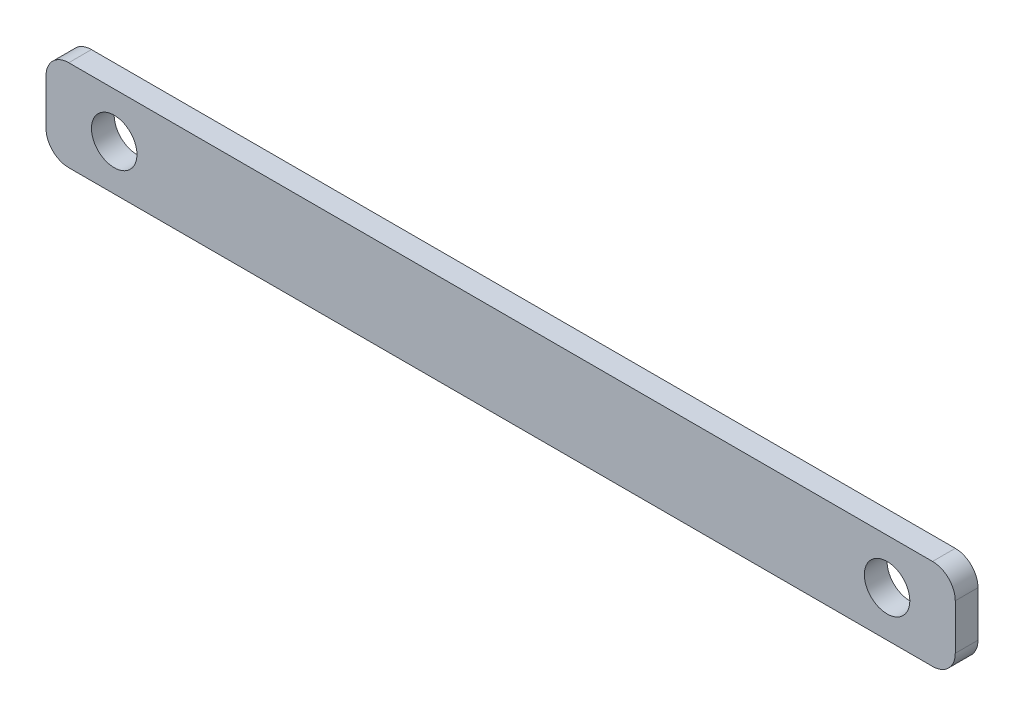
ISO-10303-21;
HEADER;
FILE_DESCRIPTION(('STEP AP214'),'2;1');
FILE_NAME('part.step','',(''),(''),'','','');
FILE_SCHEMA(('AUTOMOTIVE_DESIGN { 1 0 10303 214 1 1 1 1 }'));
ENDSEC;
DATA;
#1=APPLICATION_CONTEXT('core data for automotive mechanical design processes');
#2=APPLICATION_PROTOCOL_DEFINITION('international standard','automotive_design',2000,#1);
#3=PRODUCT_CONTEXT('',#1,'mechanical');
#4=PRODUCT('Part','Part','',(#3));
#5=PRODUCT_RELATED_PRODUCT_CATEGORY('part','',(#4));
#6=PRODUCT_DEFINITION_FORMATION('','',#4);
#7=PRODUCT_DEFINITION_CONTEXT('part definition',#1,'design');
#8=PRODUCT_DEFINITION('design','',#6,#7);
#9=PRODUCT_DEFINITION_SHAPE('','',#8);
#10=(LENGTH_UNIT() NAMED_UNIT(*) SI_UNIT(.MILLI.,.METRE.));
#11=(NAMED_UNIT(*) PLANE_ANGLE_UNIT() SI_UNIT($,.RADIAN.));
#12=(NAMED_UNIT(*) SI_UNIT($,.STERADIAN.) SOLID_ANGLE_UNIT());
#13=UNCERTAINTY_MEASURE_WITH_UNIT(LENGTH_MEASURE(1.E-05),#10,'distance_accuracy_value','');
#14=(GEOMETRIC_REPRESENTATION_CONTEXT(3) GLOBAL_UNCERTAINTY_ASSIGNED_CONTEXT((#13)) GLOBAL_UNIT_ASSIGNED_CONTEXT((#10,
#11,#12)) REPRESENTATION_CONTEXT('',''));
#15=CARTESIAN_POINT('',(0.,0.,0.));
#16=DIRECTION('',(0.,0.,1.));
#17=DIRECTION('',(1.,0.,0.));
#18=AXIS2_PLACEMENT_3D('',#15,#16,#17);
#19=CARTESIAN_POINT('',(190.,121.018152993302,5.));
#20=DIRECTION('',(0.,0.,1.));
#21=DIRECTION('',(1.,0.,0.));
#22=AXIS2_PLACEMENT_3D('',#19,#20,#21);
#23=PLANE('',#22);
#24=CARTESIAN_POINT('',(-170.,131.018152993302,5.));
#25=DIRECTION('',(0.,0.,1.));
#26=DIRECTION('',(1.,0.,0.));
#27=AXIS2_PLACEMENT_3D('',#24,#25,#26);
#28=CIRCLE('',#27,10.);
#29=CARTESIAN_POINT('',(-160.,131.018152993302,5.));
#30=VERTEX_POINT('',#29);
#31=EDGE_CURVE('E133',#30,#30,#28,.T.);
#32=ORIENTED_EDGE('',*,*,#31,.F.);
#33=EDGE_LOOP('',(#32));
#34=FACE_BOUND('',#33,.T.);
#35=CARTESIAN_POINT('',(190.,121.018152993302,5.));
#36=DIRECTION('',(0.,0.,1.));
#37=DIRECTION('',(1.,0.,0.));
#38=AXIS2_PLACEMENT_3D('',#35,#36,#37);
#39=CIRCLE('',#38,10.);
#40=CARTESIAN_POINT('',(190.,111.018152993302,5.));
#41=VERTEX_POINT('',#40);
#42=CARTESIAN_POINT('',(200.,121.018152993302,5.));
#43=VERTEX_POINT('',#42);
#44=EDGE_CURVE('E144',#41,#43,#39,.T.);
#45=ORIENTED_EDGE('',*,*,#44,.T.);
#46=DIRECTION('',(0.,1.,0.));
#47=VECTOR('',#46,1.);
#48=CARTESIAN_POINT('',(200.,141.018152993301,5.));
#49=LINE('',#48,#47);
#50=CARTESIAN_POINT('',(200.,141.018152993301,5.));
#51=VERTEX_POINT('',#50);
#52=EDGE_CURVE('E92',#43,#51,#49,.T.);
#53=ORIENTED_EDGE('',*,*,#52,.T.);
#54=CARTESIAN_POINT('',(190.,141.018152993302,5.));
#55=DIRECTION('',(0.,0.,1.));
#56=DIRECTION('',(-1.,0.,0.));
#57=AXIS2_PLACEMENT_3D('',#54,#55,#56);
#58=CIRCLE('',#57,10.);
#59=CARTESIAN_POINT('',(190.,151.018152993302,5.));
#60=VERTEX_POINT('',#59);
#61=EDGE_CURVE('E159',#51,#60,#58,.T.);
#62=ORIENTED_EDGE('',*,*,#61,.T.);
#63=DIRECTION('',(-1.,0.,0.));
#64=VECTOR('',#63,1.);
#65=CARTESIAN_POINT('',(-190.,151.018152993302,5.));
#66=LINE('',#65,#64);
#67=CARTESIAN_POINT('',(-190.,151.018152993302,5.));
#68=VERTEX_POINT('',#67);
#69=EDGE_CURVE('E172',#60,#68,#66,.T.);
#70=ORIENTED_EDGE('',*,*,#69,.T.);
#71=CARTESIAN_POINT('',(-190.,141.018152993302,5.));
#72=DIRECTION('',(0.,0.,1.));
#73=DIRECTION('',(1.,0.,0.));
#74=AXIS2_PLACEMENT_3D('',#71,#72,#73);
#75=CIRCLE('',#74,10.);
#76=CARTESIAN_POINT('',(-200.,141.018152993301,5.));
#77=VERTEX_POINT('',#76);
#78=EDGE_CURVE('E111',#68,#77,#75,.T.);
#79=ORIENTED_EDGE('',*,*,#78,.T.);
#80=DIRECTION('',(0.,-1.,0.));
#81=VECTOR('',#80,1.);
#82=CARTESIAN_POINT('',(-200.,141.018152993301,5.));
#83=LINE('',#82,#81);
#84=CARTESIAN_POINT('',(-200.,121.018152993302,5.));
#85=VERTEX_POINT('',#84);
#86=EDGE_CURVE('E105',#77,#85,#83,.T.);
#87=ORIENTED_EDGE('',*,*,#86,.T.);
#88=CARTESIAN_POINT('',(-190.,121.018152993302,5.));
#89=DIRECTION('',(0.,0.,1.));
#90=DIRECTION('',(1.,0.,0.));
#91=AXIS2_PLACEMENT_3D('',#88,#89,#90);
#92=CIRCLE('',#91,10.);
#93=CARTESIAN_POINT('',(-190.,111.018152993302,5.));
#94=VERTEX_POINT('',#93);
#95=EDGE_CURVE('E109',#85,#94,#92,.T.);
#96=ORIENTED_EDGE('',*,*,#95,.T.);
#97=DIRECTION('',(1.,0.,0.));
#98=VECTOR('',#97,1.);
#99=CARTESIAN_POINT('',(-190.,111.018152993302,5.));
#100=LINE('',#99,#98);
#101=EDGE_CURVE('E49',#94,#41,#100,.T.);
#102=ORIENTED_EDGE('',*,*,#101,.T.);
#103=EDGE_LOOP('',(#45,#53,#62,#70,#79,#87,#96,#102));
#104=FACE_BOUND('',#103,.T.);
#105=CARTESIAN_POINT('',(170.,131.018152993302,5.));
#106=DIRECTION('',(0.,0.,1.));
#107=DIRECTION('',(1.,0.,0.));
#108=AXIS2_PLACEMENT_3D('',#105,#106,#107);
#109=CIRCLE('',#108,10.);
#110=CARTESIAN_POINT('',(180.,131.018152993302,5.));
#111=VERTEX_POINT('',#110);
#112=EDGE_CURVE('E181',#111,#111,#109,.T.);
#113=ORIENTED_EDGE('',*,*,#112,.F.);
#114=EDGE_LOOP('',(#113));
#115=FACE_BOUND('',#114,.T.);
#116=ADVANCED_FACE('F32',(#34,#104,#115),#23,.T.);
#117=CARTESIAN_POINT('',(190.,121.018152993302,-5.));
#118=DIRECTION('',(0.,0.,1.));
#119=DIRECTION('',(1.,0.,0.));
#120=AXIS2_PLACEMENT_3D('',#117,#118,#119);
#121=PLANE('',#120);
#122=CARTESIAN_POINT('',(190.,121.018152993302,-5.));
#123=DIRECTION('',(0.,0.,1.));
#124=DIRECTION('',(1.,0.,0.));
#125=AXIS2_PLACEMENT_3D('',#122,#123,#124);
#126=CIRCLE('',#125,10.);
#127=CARTESIAN_POINT('',(190.,111.018152993302,-5.));
#128=VERTEX_POINT('',#127);
#129=CARTESIAN_POINT('',(200.,121.018152993302,-5.));
#130=VERTEX_POINT('',#129);
#131=EDGE_CURVE('E129',#128,#130,#126,.T.);
#132=ORIENTED_EDGE('',*,*,#131,.F.);
#133=DIRECTION('',(1.,0.,0.));
#134=VECTOR('',#133,1.);
#135=CARTESIAN_POINT('',(-190.,111.018152993302,-5.));
#136=LINE('',#135,#134);
#137=CARTESIAN_POINT('',(-190.,111.018152993302,-5.));
#138=VERTEX_POINT('',#137);
#139=EDGE_CURVE('E84',#138,#128,#136,.T.);
#140=ORIENTED_EDGE('',*,*,#139,.F.);
#141=CARTESIAN_POINT('',(-190.,121.018152993302,-5.));
#142=DIRECTION('',(0.,0.,1.));
#143=DIRECTION('',(1.,0.,0.));
#144=AXIS2_PLACEMENT_3D('',#141,#142,#143);
#145=CIRCLE('',#144,10.);
#146=CARTESIAN_POINT('',(-200.,121.018152993302,-5.));
#147=VERTEX_POINT('',#146);
#148=EDGE_CURVE('E78',#147,#138,#145,.T.);
#149=ORIENTED_EDGE('',*,*,#148,.F.);
#150=DIRECTION('',(0.,-1.,0.));
#151=VECTOR('',#150,1.);
#152=CARTESIAN_POINT('',(-200.,141.018152993301,-5.));
#153=LINE('',#152,#151);
#154=CARTESIAN_POINT('',(-200.,141.018152993301,-5.));
#155=VERTEX_POINT('',#154);
#156=EDGE_CURVE('E119',#155,#147,#153,.T.);
#157=ORIENTED_EDGE('',*,*,#156,.F.);
#158=CARTESIAN_POINT('',(-190.,141.018152993302,-5.));
#159=DIRECTION('',(0.,0.,1.));
#160=DIRECTION('',(1.,0.,0.));
#161=AXIS2_PLACEMENT_3D('',#158,#159,#160);
#162=CIRCLE('',#161,10.);
#163=CARTESIAN_POINT('',(-190.,151.018152993302,-5.));
#164=VERTEX_POINT('',#163);
#165=EDGE_CURVE('E139',#164,#155,#162,.T.);
#166=ORIENTED_EDGE('',*,*,#165,.F.);
#167=DIRECTION('',(-1.,0.,0.));
#168=VECTOR('',#167,1.);
#169=CARTESIAN_POINT('',(-190.,151.018152993302,-5.));
#170=LINE('',#169,#168);
#171=CARTESIAN_POINT('',(190.,151.018152993302,-5.));
#172=VERTEX_POINT('',#171);
#173=EDGE_CURVE('E137',#172,#164,#170,.T.);
#174=ORIENTED_EDGE('',*,*,#173,.F.);
#175=CARTESIAN_POINT('',(190.,141.018152993302,-5.));
#176=DIRECTION('',(0.,0.,1.));
#177=DIRECTION('',(-1.,0.,0.));
#178=AXIS2_PLACEMENT_3D('',#175,#176,#177);
#179=CIRCLE('',#178,10.);
#180=CARTESIAN_POINT('',(200.,141.018152993301,-5.));
#181=VERTEX_POINT('',#180);
#182=EDGE_CURVE('E135',#181,#172,#179,.T.);
#183=ORIENTED_EDGE('',*,*,#182,.F.);
#184=DIRECTION('',(0.,1.,0.));
#185=VECTOR('',#184,1.);
#186=CARTESIAN_POINT('',(200.,141.018152993301,-5.));
#187=LINE('',#186,#185);
#188=EDGE_CURVE('E132',#130,#181,#187,.T.);
#189=ORIENTED_EDGE('',*,*,#188,.F.);
#190=EDGE_LOOP('',(#132,#140,#149,#157,#166,#174,#183,#189));
#191=FACE_BOUND('',#190,.T.);
#192=CARTESIAN_POINT('',(-170.,131.018152993302,-5.));
#193=DIRECTION('',(0.,0.,1.));
#194=DIRECTION('',(1.,0.,0.));
#195=AXIS2_PLACEMENT_3D('',#192,#193,#194);
#196=CIRCLE('',#195,10.);
#197=CARTESIAN_POINT('',(-160.,131.018152993302,-5.));
#198=VERTEX_POINT('',#197);
#199=EDGE_CURVE('E178',#198,#198,#196,.T.);
#200=ORIENTED_EDGE('',*,*,#199,.T.);
#201=EDGE_LOOP('',(#200));
#202=FACE_BOUND('',#201,.T.);
#203=CARTESIAN_POINT('',(170.,131.018152993302,-5.));
#204=DIRECTION('',(0.,0.,1.));
#205=DIRECTION('',(1.,0.,0.));
#206=AXIS2_PLACEMENT_3D('',#203,#204,#205);
#207=CIRCLE('',#206,10.);
#208=CARTESIAN_POINT('',(180.,131.018152993302,-5.));
#209=VERTEX_POINT('',#208);
#210=EDGE_CURVE('E184',#209,#209,#207,.T.);
#211=ORIENTED_EDGE('',*,*,#210,.T.);
#212=EDGE_LOOP('',(#211));
#213=FACE_BOUND('',#212,.T.);
#214=ADVANCED_FACE('F163',(#191,#202,#213),#121,.F.);
#215=CARTESIAN_POINT('',(190.,121.018152993302,5.));
#216=DIRECTION('',(0.,0.,-1.));
#217=DIRECTION('',(-1.,0.,0.));
#218=AXIS2_PLACEMENT_3D('',#215,#216,#217);
#219=CYLINDRICAL_SURFACE('',#218,10.);
#220=ORIENTED_EDGE('',*,*,#131,.T.);
#221=DIRECTION('',(0.,0.,-1.));
#222=VECTOR('',#221,1.);
#223=CARTESIAN_POINT('',(200.,121.018152993302,5.));
#224=LINE('',#223,#222);
#225=EDGE_CURVE('E11',#43,#130,#224,.T.);
#226=ORIENTED_EDGE('',*,*,#225,.F.);
#227=ORIENTED_EDGE('',*,*,#44,.F.);
#228=DIRECTION('',(0.,0.,-1.));
#229=VECTOR('',#228,1.);
#230=CARTESIAN_POINT('',(190.,111.018152993302,5.));
#231=LINE('',#230,#229);
#232=EDGE_CURVE('E125',#41,#128,#231,.T.);
#233=ORIENTED_EDGE('',*,*,#232,.T.);
#234=EDGE_LOOP('',(#220,#226,#227,#233));
#235=FACE_BOUND('',#234,.T.);
#236=ADVANCED_FACE('F34',(#235),#219,.T.);
#237=CARTESIAN_POINT('',(200.,141.018152993301,5.));
#238=DIRECTION('',(-1.,0.,0.));
#239=DIRECTION('',(0.,0.,1.));
#240=AXIS2_PLACEMENT_3D('',#237,#238,#239);
#241=PLANE('',#240);
#242=ORIENTED_EDGE('',*,*,#188,.T.);
#243=DIRECTION('',(0.,0.,-1.));
#244=VECTOR('',#243,1.);
#245=CARTESIAN_POINT('',(200.,141.018152993301,5.));
#246=LINE('',#245,#244);
#247=EDGE_CURVE('E41',#51,#181,#246,.T.);
#248=ORIENTED_EDGE('',*,*,#247,.F.);
#249=ORIENTED_EDGE('',*,*,#52,.F.);
#250=ORIENTED_EDGE('',*,*,#225,.T.);
#251=EDGE_LOOP('',(#242,#248,#249,#250));
#252=FACE_BOUND('',#251,.T.);
#253=ADVANCED_FACE('F216',(#252),#241,.F.);
#254=CARTESIAN_POINT('',(190.,141.018152993302,5.));
#255=DIRECTION('',(0.,0.,-1.));
#256=DIRECTION('',(-1.,0.,0.));
#257=AXIS2_PLACEMENT_3D('',#254,#255,#256);
#258=CYLINDRICAL_SURFACE('',#257,10.);
#259=ORIENTED_EDGE('',*,*,#182,.T.);
#260=DIRECTION('',(0.,0.,-1.));
#261=VECTOR('',#260,1.);
#262=CARTESIAN_POINT('',(190.,151.018152993302,5.));
#263=LINE('',#262,#261);
#264=EDGE_CURVE('E151',#60,#172,#263,.T.);
#265=ORIENTED_EDGE('',*,*,#264,.F.);
#266=ORIENTED_EDGE('',*,*,#61,.F.);
#267=ORIENTED_EDGE('',*,*,#247,.T.);
#268=EDGE_LOOP('',(#259,#265,#266,#267));
#269=FACE_BOUND('',#268,.T.);
#270=ADVANCED_FACE('F157',(#269),#258,.T.);
#271=CARTESIAN_POINT('',(-190.,151.018152993302,5.));
#272=DIRECTION('',(0.,-1.,0.));
#273=DIRECTION('',(0.,0.,-1.));
#274=AXIS2_PLACEMENT_3D('',#271,#272,#273);
#275=PLANE('',#274);
#276=ORIENTED_EDGE('',*,*,#173,.T.);
#277=DIRECTION('',(0.,0.,-1.));
#278=VECTOR('',#277,1.);
#279=CARTESIAN_POINT('',(-190.,151.018152993302,5.));
#280=LINE('',#279,#278);
#281=EDGE_CURVE('E148',#68,#164,#280,.T.);
#282=ORIENTED_EDGE('',*,*,#281,.F.);
#283=ORIENTED_EDGE('',*,*,#69,.F.);
#284=ORIENTED_EDGE('',*,*,#264,.T.);
#285=EDGE_LOOP('',(#276,#282,#283,#284));
#286=FACE_BOUND('',#285,.T.);
#287=ADVANCED_FACE('F168',(#286),#275,.F.);
#288=CARTESIAN_POINT('',(-190.,141.018152993302,5.));
#289=DIRECTION('',(0.,0.,-1.));
#290=DIRECTION('',(-1.,0.,0.));
#291=AXIS2_PLACEMENT_3D('',#288,#289,#290);
#292=CYLINDRICAL_SURFACE('',#291,10.);
#293=ORIENTED_EDGE('',*,*,#165,.T.);
#294=DIRECTION('',(0.,0.,-1.));
#295=VECTOR('',#294,1.);
#296=CARTESIAN_POINT('',(-200.,141.018152993301,5.));
#297=LINE('',#296,#295);
#298=EDGE_CURVE('E120',#77,#155,#297,.T.);
#299=ORIENTED_EDGE('',*,*,#298,.F.);
#300=ORIENTED_EDGE('',*,*,#78,.F.);
#301=ORIENTED_EDGE('',*,*,#281,.T.);
#302=EDGE_LOOP('',(#293,#299,#300,#301));
#303=FACE_BOUND('',#302,.T.);
#304=ADVANCED_FACE('F171',(#303),#292,.T.);
#305=CARTESIAN_POINT('',(-200.,141.018152993301,5.));
#306=DIRECTION('',(1.,0.,0.));
#307=DIRECTION('',(0.,0.,-1.));
#308=AXIS2_PLACEMENT_3D('',#305,#306,#307);
#309=PLANE('',#308);
#310=ORIENTED_EDGE('',*,*,#156,.T.);
#311=DIRECTION('',(0.,0.,-1.));
#312=VECTOR('',#311,1.);
#313=CARTESIAN_POINT('',(-200.,121.018152993302,5.));
#314=LINE('',#313,#312);
#315=EDGE_CURVE('E116',#85,#147,#314,.T.);
#316=ORIENTED_EDGE('',*,*,#315,.F.);
#317=ORIENTED_EDGE('',*,*,#86,.F.);
#318=ORIENTED_EDGE('',*,*,#298,.T.);
#319=EDGE_LOOP('',(#310,#316,#317,#318));
#320=FACE_BOUND('',#319,.T.);
#321=ADVANCED_FACE('F117',(#320),#309,.F.);
#322=CARTESIAN_POINT('',(-190.,121.018152993302,5.));
#323=DIRECTION('',(0.,0.,-1.));
#324=DIRECTION('',(-1.,0.,0.));
#325=AXIS2_PLACEMENT_3D('',#322,#323,#324);
#326=CYLINDRICAL_SURFACE('',#325,10.);
#327=ORIENTED_EDGE('',*,*,#148,.T.);
#328=DIRECTION('',(0.,0.,-1.));
#329=VECTOR('',#328,1.);
#330=CARTESIAN_POINT('',(-190.,111.018152993302,5.));
#331=LINE('',#330,#329);
#332=EDGE_CURVE('E121',#94,#138,#331,.T.);
#333=ORIENTED_EDGE('',*,*,#332,.F.);
#334=ORIENTED_EDGE('',*,*,#95,.F.);
#335=ORIENTED_EDGE('',*,*,#315,.T.);
#336=EDGE_LOOP('',(#327,#333,#334,#335));
#337=FACE_BOUND('',#336,.T.);
#338=ADVANCED_FACE('F123',(#337),#326,.T.);
#339=CARTESIAN_POINT('',(-190.,111.018152993302,5.));
#340=DIRECTION('',(0.,1.,0.));
#341=DIRECTION('',(0.,0.,1.));
#342=AXIS2_PLACEMENT_3D('',#339,#340,#341);
#343=PLANE('',#342);
#344=ORIENTED_EDGE('',*,*,#139,.T.);
#345=ORIENTED_EDGE('',*,*,#232,.F.);
#346=ORIENTED_EDGE('',*,*,#101,.F.);
#347=ORIENTED_EDGE('',*,*,#332,.T.);
#348=EDGE_LOOP('',(#344,#345,#346,#347));
#349=FACE_BOUND('',#348,.T.);
#350=ADVANCED_FACE('F204',(#349),#343,.F.);
#351=CARTESIAN_POINT('',(-170.,131.018152993302,5.));
#352=DIRECTION('',(0.,0.,-1.));
#353=DIRECTION('',(-1.,0.,0.));
#354=AXIS2_PLACEMENT_3D('',#351,#352,#353);
#355=CYLINDRICAL_SURFACE('',#354,10.);
#356=ORIENTED_EDGE('',*,*,#31,.T.);
#357=EDGE_LOOP('',(#356));
#358=FACE_BOUND('',#357,.T.);
#359=ORIENTED_EDGE('',*,*,#199,.F.);
#360=EDGE_LOOP('',(#359));
#361=FACE_BOUND('',#360,.T.);
#362=ADVANCED_FACE('F201',(#358,#361),#355,.F.);
#363=CARTESIAN_POINT('',(170.,131.018152993302,5.));
#364=DIRECTION('',(0.,0.,-1.));
#365=DIRECTION('',(-1.,0.,0.));
#366=AXIS2_PLACEMENT_3D('',#363,#364,#365);
#367=CYLINDRICAL_SURFACE('',#366,10.);
#368=ORIENTED_EDGE('',*,*,#112,.T.);
#369=EDGE_LOOP('',(#368));
#370=FACE_BOUND('',#369,.T.);
#371=ORIENTED_EDGE('',*,*,#210,.F.);
#372=EDGE_LOOP('',(#371));
#373=FACE_BOUND('',#372,.T.);
#374=ADVANCED_FACE('F190',(#370,#373),#367,.F.);
#375=CLOSED_SHELL('',(#116,#214,#236,#253,#270,#287,#304,#321,#338,#350,#362,#374));
#376=MANIFOLD_SOLID_BREP('B2',#375);
#377=ADVANCED_BREP_SHAPE_REPRESENTATION('',(#18,#376),#14);
#378=SHAPE_DEFINITION_REPRESENTATION(#9,#377);
ENDSEC;
END-ISO-10303-21;
